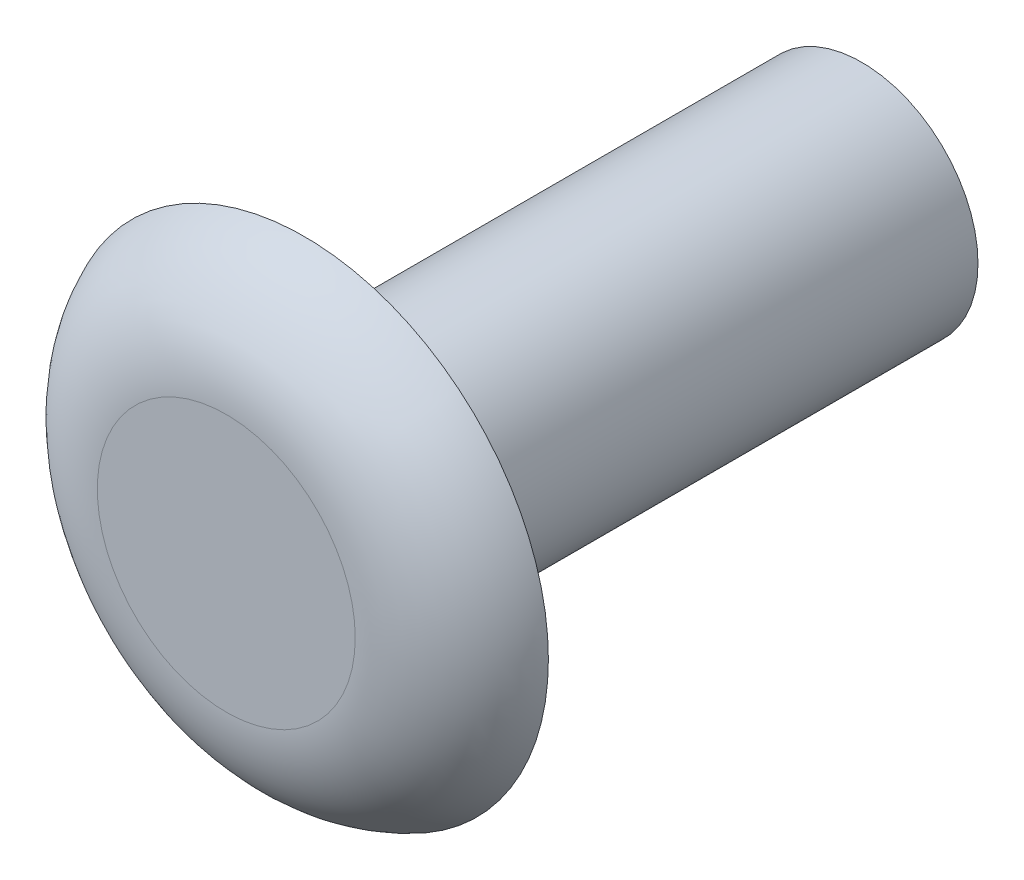
ISO-10303-21;
HEADER;
FILE_DESCRIPTION(('STEP AP214'),'2;1');
FILE_NAME('part.step','',(''),(''),'','','');
FILE_SCHEMA(('AUTOMOTIVE_DESIGN { 1 0 10303 214 1 1 1 1 }'));
ENDSEC;
DATA;
#1=APPLICATION_CONTEXT('core data for automotive mechanical design processes');
#2=APPLICATION_PROTOCOL_DEFINITION('international standard','automotive_design',2000,#1);
#3=PRODUCT_CONTEXT('',#1,'mechanical');
#4=PRODUCT('Part','Part','',(#3));
#5=PRODUCT_RELATED_PRODUCT_CATEGORY('part','',(#4));
#6=PRODUCT_DEFINITION_FORMATION('','',#4);
#7=PRODUCT_DEFINITION_CONTEXT('part definition',#1,'design');
#8=PRODUCT_DEFINITION('design','',#6,#7);
#9=PRODUCT_DEFINITION_SHAPE('','',#8);
#10=(LENGTH_UNIT() NAMED_UNIT(*) SI_UNIT(.MILLI.,.METRE.));
#11=(NAMED_UNIT(*) PLANE_ANGLE_UNIT() SI_UNIT($,.RADIAN.));
#12=(NAMED_UNIT(*) SI_UNIT($,.STERADIAN.) SOLID_ANGLE_UNIT());
#13=UNCERTAINTY_MEASURE_WITH_UNIT(LENGTH_MEASURE(1.E-05),#10,'distance_accuracy_value','');
#14=(GEOMETRIC_REPRESENTATION_CONTEXT(3) GLOBAL_UNCERTAINTY_ASSIGNED_CONTEXT((#13)) GLOBAL_UNIT_ASSIGNED_CONTEXT((#10,
#11,#12)) REPRESENTATION_CONTEXT('',''));
#15=CARTESIAN_POINT('',(0.,0.,0.));
#16=DIRECTION('',(0.,0.,1.));
#17=DIRECTION('',(1.,0.,0.));
#18=AXIS2_PLACEMENT_3D('',#15,#16,#17);
#19=CARTESIAN_POINT('',(0.,0.,1.6002));
#20=DIRECTION('',(0.,0.,1.));
#21=DIRECTION('',(1.,0.,0.));
#22=AXIS2_PLACEMENT_3D('',#19,#20,#21);
#23=PLANE('',#22);
#24=CARTESIAN_POINT('',(0.,0.,1.6002));
#25=DIRECTION('',(0.,0.,1.));
#26=DIRECTION('',(1.,0.,0.));
#27=AXIS2_PLACEMENT_3D('',#24,#25,#26);
#28=CIRCLE('',#27,2.64405934475841);
#29=CARTESIAN_POINT('',(2.64405934475841,0.,1.6002));
#30=VERTEX_POINT('',#29);
#31=EDGE_CURVE('E10',#30,#30,#28,.T.);
#32=ORIENTED_EDGE('',*,*,#31,.T.);
#33=EDGE_LOOP('',(#32));
#34=FACE_BOUND('',#33,.T.);
#35=ADVANCED_FACE('F32',(#34),#23,.T.);
#36=CARTESIAN_POINT('',(0.,0.,0.));
#37=DIRECTION('',(0.,0.,1.));
#38=DIRECTION('',(1.,0.,0.));
#39=AXIS2_PLACEMENT_3D('',#36,#37,#38);
#40=PLANE('',#39);
#41=CARTESIAN_POINT('',(0.,0.,0.));
#42=DIRECTION('',(0.,0.,1.));
#43=DIRECTION('',(1.,0.,0.));
#44=AXIS2_PLACEMENT_3D('',#41,#42,#43);
#45=CIRCLE('',#44,2.38125);
#46=CARTESIAN_POINT('',(2.38125,0.,0.));
#47=VERTEX_POINT('',#46);
#48=EDGE_CURVE('E47',#47,#47,#45,.T.);
#49=ORIENTED_EDGE('',*,*,#48,.T.);
#50=EDGE_LOOP('',(#49));
#51=FACE_BOUND('',#50,.T.);
#52=CARTESIAN_POINT('',(0.,0.,0.));
#53=DIRECTION('',(0.,0.,1.));
#54=DIRECTION('',(1.,0.,0.));
#55=AXIS2_PLACEMENT_3D('',#52,#53,#54);
#56=CIRCLE('',#55,5.0038);
#57=CARTESIAN_POINT('',(5.0038,0.,0.));
#58=VERTEX_POINT('',#57);
#59=EDGE_CURVE('E39',#58,#58,#56,.T.);
#60=ORIENTED_EDGE('',*,*,#59,.F.);
#61=EDGE_LOOP('',(#60));
#62=FACE_BOUND('',#61,.T.);
#63=ADVANCED_FACE('F53',(#51,#62),#40,.F.);
#64=CARTESIAN_POINT('',(0.,0.,-11.43));
#65=DIRECTION('',(0.,0.,1.));
#66=DIRECTION('',(1.,0.,0.));
#67=AXIS2_PLACEMENT_3D('',#64,#65,#66);
#68=CYLINDRICAL_SURFACE('',#67,2.38125);
#69=CARTESIAN_POINT('',(0.,0.,-11.43));
#70=DIRECTION('',(0.,0.,1.));
#71=DIRECTION('',(1.,0.,0.));
#72=AXIS2_PLACEMENT_3D('',#69,#70,#71);
#73=CIRCLE('',#72,2.38125);
#74=CARTESIAN_POINT('',(2.38125,0.,-11.43));
#75=VERTEX_POINT('',#74);
#76=EDGE_CURVE('E43',#75,#75,#73,.T.);
#77=ORIENTED_EDGE('',*,*,#76,.T.);
#78=EDGE_LOOP('',(#77));
#79=FACE_BOUND('',#78,.T.);
#80=ORIENTED_EDGE('',*,*,#48,.F.);
#81=EDGE_LOOP('',(#80));
#82=FACE_BOUND('',#81,.T.);
#83=ADVANCED_FACE('F56',(#79,#82),#68,.T.);
#84=CARTESIAN_POINT('',(0.,0.,-11.43));
#85=DIRECTION('',(0.,0.,1.));
#86=DIRECTION('',(1.,0.,0.));
#87=AXIS2_PLACEMENT_3D('',#84,#85,#86);
#88=PLANE('',#87);
#89=ORIENTED_EDGE('',*,*,#76,.F.);
#90=EDGE_LOOP('',(#89));
#91=FACE_BOUND('',#90,.T.);
#92=ADVANCED_FACE('F58',(#91),#88,.F.);
#93=CARTESIAN_POINT('',(0.,0.,-0.9398));
#94=DIRECTION('',(0.,0.,-1.));
#95=DIRECTION('',(-1.,0.,0.));
#96=AXIS2_PLACEMENT_3D('',#93,#94,#95);
#97=TOROIDAL_SURFACE('',#96,2.64405934475841,2.54);
#98=ORIENTED_EDGE('',*,*,#59,.T.);
#99=EDGE_LOOP('',(#98));
#100=FACE_BOUND('',#99,.T.);
#101=ORIENTED_EDGE('',*,*,#31,.F.);
#102=EDGE_LOOP('',(#101));
#103=FACE_BOUND('',#102,.T.);
#104=ADVANCED_FACE('F34',(#100,#103),#97,.T.);
#105=CLOSED_SHELL('',(#35,#63,#83,#92,#104));
#106=MANIFOLD_SOLID_BREP('B2',#105);
#107=ADVANCED_BREP_SHAPE_REPRESENTATION('',(#18,#106),#14);
#108=SHAPE_DEFINITION_REPRESENTATION(#9,#107);
ENDSEC;
END-ISO-10303-21;
